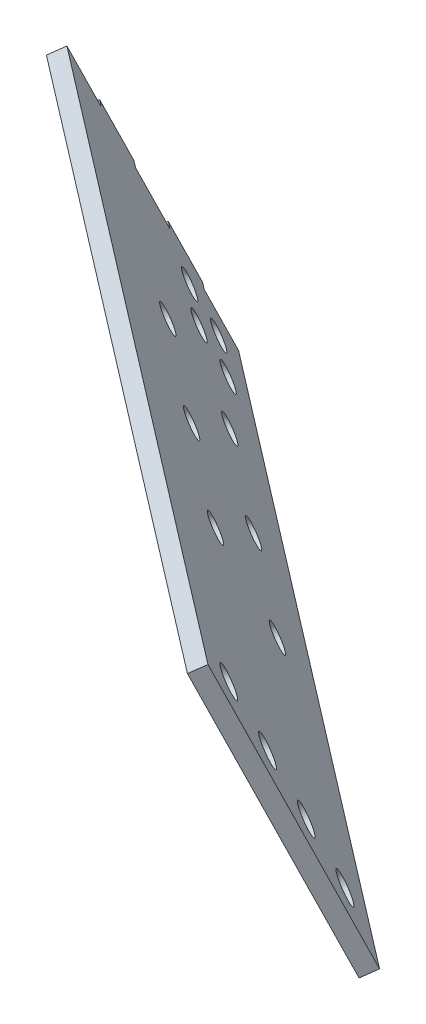
ISO-10303-21;
HEADER;
FILE_DESCRIPTION(('STEP AP214'),'2;1');
FILE_NAME('part.step','',(''),(''),'','','');
FILE_SCHEMA(('AUTOMOTIVE_DESIGN { 1 0 10303 214 1 1 1 1 }'));
ENDSEC;
DATA;
#1=APPLICATION_CONTEXT('core data for automotive mechanical design processes');
#2=APPLICATION_PROTOCOL_DEFINITION('international standard','automotive_design',2000,#1);
#3=PRODUCT_CONTEXT('',#1,'mechanical');
#4=PRODUCT('Part','Part','',(#3));
#5=PRODUCT_RELATED_PRODUCT_CATEGORY('part','',(#4));
#6=PRODUCT_DEFINITION_FORMATION('','',#4);
#7=PRODUCT_DEFINITION_CONTEXT('part definition',#1,'design');
#8=PRODUCT_DEFINITION('design','',#6,#7);
#9=PRODUCT_DEFINITION_SHAPE('','',#8);
#10=(LENGTH_UNIT() NAMED_UNIT(*) SI_UNIT(.MILLI.,.METRE.));
#11=(NAMED_UNIT(*) PLANE_ANGLE_UNIT() SI_UNIT($,.RADIAN.));
#12=(NAMED_UNIT(*) SI_UNIT($,.STERADIAN.) SOLID_ANGLE_UNIT());
#13=UNCERTAINTY_MEASURE_WITH_UNIT(LENGTH_MEASURE(1.E-05),#10,'distance_accuracy_value','');
#14=(GEOMETRIC_REPRESENTATION_CONTEXT(3) GLOBAL_UNCERTAINTY_ASSIGNED_CONTEXT((#13)) GLOBAL_UNIT_ASSIGNED_CONTEXT((#10,
#11,#12)) REPRESENTATION_CONTEXT('',''));
#15=CARTESIAN_POINT('',(0.,0.,0.));
#16=DIRECTION('',(0.,0.,1.));
#17=DIRECTION('',(1.,0.,0.));
#18=AXIS2_PLACEMENT_3D('',#15,#16,#17);
#19=CARTESIAN_POINT('',(14.5467046392581,44.45,-33.02));
#20=DIRECTION('',(0.79335334029123,0.,0.608761429008727));
#21=DIRECTION('',(0.247605580069034,-0.913545457642603,-0.322685874403024));
#22=AXIS2_PLACEMENT_3D('',#19,#20,#21);
#23=PLANE('',#22);
#24=DIRECTION('',(0.556131238258943,0.406736643075794,-0.72476434032864));
#25=VECTOR('',#24,1.);
#26=CARTESIAN_POINT('',(8.75342284130712,36.2336291981627,-25.4700481688912));
#27=LINE('',#26,#25);
#28=CARTESIAN_POINT('',(15.4468292939168,41.1289731097893,-34.193065288671));
#29=VERTEX_POINT('',#28);
#30=CARTESIAN_POINT('',(17.1136658412265,42.3480441764161,-36.365328969504));
#31=VERTEX_POINT('',#30);
#32=EDGE_CURVE('E134',#29,#31,#27,.T.);
#33=ORIENTED_EDGE('',*,*,#32,.F.);
#34=DIRECTION('',(0.247605580069034,-0.913545457642603,-0.322685874403024));
#35=VECTOR('',#34,1.);
#36=CARTESIAN_POINT('',(14.5467046392581,44.45,-33.02));
#37=LINE('',#36,#35);
#38=CARTESIAN_POINT('',(12.6599501191321,51.4112163872367,-30.561133637049));
#39=VERTEX_POINT('',#38);
#40=EDGE_CURVE('E141',#39,#29,#37,.T.);
#41=ORIENTED_EDGE('',*,*,#40,.F.);
#42=DIRECTION('',(-0.556131238258943,-0.406736643075794,0.72476434032864));
#43=VECTOR('',#42,1.);
#44=CARTESIAN_POINT('',(12.6599501191321,51.4112163872367,-30.561133637049));
#45=LINE('',#44,#43);
#46=CARTESIAN_POINT('',(14.3267866664418,52.6302874538634,-32.733397317882));
#47=VERTEX_POINT('',#46);
#48=EDGE_CURVE('E45',#47,#39,#45,.T.);
#49=ORIENTED_EDGE('',*,*,#48,.F.);
#50=DIRECTION('',(-0.247605580069033,0.913545457642604,0.322685874403023));
#51=VECTOR('',#50,1.);
#52=CARTESIAN_POINT('',(22.7379885264077,21.5969995516098,-43.6950889978784));
#53=LINE('',#52,#51);
#54=EDGE_CURVE('E151',#47,#31,#53,.F.);
#55=ORIENTED_EDGE('',*,*,#54,.T.);
#56=EDGE_LOOP('',(#33,#41,#49,#55));
#57=FACE_BOUND('',#56,.T.);
#58=ADVANCED_FACE('F35',(#57),#23,.F.);
#59=DIRECTION('',(0.556131238258943,0.406736643075794,-0.72476434032864));
#60=VECTOR('',#59,1.);
#61=CARTESIAN_POINT('',(11.5403020160918,25.9513859207153,-29.1019798205133));
#62=LINE('',#61,#60);
#63=CARTESIAN_POINT('',(18.2337084687014,30.846729832342,-37.8249969402931));
#64=VERTEX_POINT('',#63);
#65=CARTESIAN_POINT('',(19.9005450160111,32.0658008989688,-39.9972606211261));
#66=VERTEX_POINT('',#65);
#67=EDGE_CURVE('E160',#64,#66,#62,.T.);
#68=ORIENTED_EDGE('',*,*,#67,.T.);
#69=CARTESIAN_POINT('',(22.6874241907957,21.7835576215214,-43.6291922727481));
#70=VERTEX_POINT('',#69);
#71=EDGE_CURVE('E213',#66,#70,#53,.F.);
#72=ORIENTED_EDGE('',*,*,#71,.T.);
#73=DIRECTION('',(0.556131238258943,0.406736643075794,-0.72476434032864));
#74=VECTOR('',#73,1.);
#75=CARTESIAN_POINT('',(14.3271811908764,15.669142643268,-32.7339114721353));
#76=LINE('',#75,#74);
#77=CARTESIAN_POINT('',(21.020587643486,20.5644865548946,-41.4569285919151));
#78=VERTEX_POINT('',#77);
#79=EDGE_CURVE('E167',#78,#70,#76,.T.);
#80=ORIENTED_EDGE('',*,*,#79,.F.);
#81=EDGE_CURVE('E39',#64,#78,#37,.T.);
#82=ORIENTED_EDGE('',*,*,#81,.F.);
#83=EDGE_LOOP('',(#68,#72,#80,#82));
#84=FACE_BOUND('',#83,.T.);
#85=ADVANCED_FACE('F244',(#84),#23,.F.);
#86=DIRECTION('',(0.556131238258943,0.406736643075794,-0.72476434032864));
#87=VECTOR('',#86,1.);
#88=CARTESIAN_POINT('',(17.114060365661,5.38689936582066,-36.3658431237573));
#89=LINE('',#88,#87);
#90=CARTESIAN_POINT('',(23.8074668182706,10.2822432774473,-45.0888602435371));
#91=VERTEX_POINT('',#90);
#92=CARTESIAN_POINT('',(25.4743033655803,11.5013143440741,-47.2611239243701));
#93=VERTEX_POINT('',#92);
#94=EDGE_CURVE('E174',#91,#93,#89,.T.);
#95=ORIENTED_EDGE('',*,*,#94,.T.);
#96=CARTESIAN_POINT('',(28.261182540365,1.21907106662677,-50.8930555759921));
#97=VERTEX_POINT('',#96);
#98=EDGE_CURVE('E212',#93,#97,#53,.F.);
#99=ORIENTED_EDGE('',*,*,#98,.T.);
#100=DIRECTION('',(-0.556131238258943,-0.406736643075794,0.72476434032864));
#101=VECTOR('',#100,1.);
#102=CARTESIAN_POINT('',(26.5943459930553,0.,-48.7207918951591));
#103=LINE('',#102,#101);
#104=CARTESIAN_POINT('',(26.5943459930553,0.,-48.7207918951591));
#105=VERTEX_POINT('',#104);
#106=EDGE_CURVE('E11',#97,#105,#103,.T.);
#107=ORIENTED_EDGE('',*,*,#106,.T.);
#108=EDGE_CURVE('E201',#91,#105,#37,.T.);
#109=ORIENTED_EDGE('',*,*,#108,.F.);
#110=EDGE_LOOP('',(#95,#99,#107,#109));
#111=FACE_BOUND('',#110,.T.);
#112=ADVANCED_FACE('F231',(#111),#23,.F.);
#113=CARTESIAN_POINT('',(150.825537827718,51.4112163872366,75.4570506217247));
#114=DIRECTION('',(-0.247605580069033,0.913545457642604,0.322685874403023));
#115=DIRECTION('',(0.793353340291231,0.,0.608761429008727));
#116=AXIS2_PLACEMENT_3D('',#113,#114,#115);
#117=PLANE('',#116);
#118=DIRECTION('',(0.556131238258943,0.406736643075795,-0.72476434032864));
#119=VECTOR('',#118,1.);
#120=CARTESIAN_POINT('',(-31.9766845844257,-64.1354295160414,262.308313646661));
#121=LINE('',#120,#119);
#122=CARTESIAN_POINT('',(126.010308613242,51.4112163872367,56.4156555325728));
#123=VERTEX_POINT('',#122);
#124=CARTESIAN_POINT('',(127.677145160551,52.6302874538634,54.2433918517398));
#125=VERTEX_POINT('',#124);
#126=EDGE_CURVE('E191',#123,#125,#121,.T.);
#127=ORIENTED_EDGE('',*,*,#126,.T.);
#128=DIRECTION('',(-0.79335334029123,0.,-0.608761429008727));
#129=VECTOR('',#128,1.);
#130=CARTESIAN_POINT('',(21.1183876367849,52.6302874538634,-27.5220186017536));
#131=LINE('',#130,#129);
#132=EDGE_CURVE('E202',#47,#125,#131,.F.);
#133=ORIENTED_EDGE('',*,*,#132,.F.);
#134=ORIENTED_EDGE('',*,*,#48,.T.);
#135=DIRECTION('',(0.793353340291231,0.,0.608761429008727));
#136=VECTOR('',#135,1.);
#137=CARTESIAN_POINT('',(150.825537827718,51.4112163872366,75.4570506217247));
#138=LINE('',#137,#136);
#139=EDGE_CURVE('E144',#39,#123,#138,.T.);
#140=ORIENTED_EDGE('',*,*,#139,.T.);
#141=EDGE_LOOP('',(#127,#133,#134,#140));
#142=FACE_BOUND('',#141,.T.);
#143=ADVANCED_FACE('F219',(#142),#117,.T.);
#144=CARTESIAN_POINT('',(33.3859469633983,0.,-43.5094131790307));
#145=DIRECTION('',(0.247605580069033,-0.913545457642604,-0.322685874403023));
#146=DIRECTION('',(-0.79335334029123,0.,-0.608761429008727));
#147=AXIS2_PLACEMENT_3D('',#144,#145,#146);
#148=PLANE('',#147);
#149=DIRECTION('',(-0.79335334029123,0.,-0.608761429008727));
#150=VECTOR('',#149,1.);
#151=CARTESIAN_POINT('',(35.052783510708,1.21907106662677,-45.6816768598637));
#152=LINE('',#151,#150);
#153=CARTESIAN_POINT('',(141.611541034475,1.21907106662672,36.0837335936297));
#154=VERTEX_POINT('',#153);
#155=EDGE_CURVE('E199',#154,#97,#152,.T.);
#156=ORIENTED_EDGE('',*,*,#155,.F.);
#157=DIRECTION('',(0.556131238258943,0.406736643075795,-0.72476434032864));
#158=VECTOR('',#157,1.);
#159=CARTESIAN_POINT('',(-18.0422887105026,-115.546645903278,244.14865538855));
#160=LINE('',#159,#158);
#161=CARTESIAN_POINT('',(139.944704487165,0.,38.2559972744627));
#162=VERTEX_POINT('',#161);
#163=EDGE_CURVE('E192',#162,#154,#160,.T.);
#164=ORIENTED_EDGE('',*,*,#163,.F.);
#165=DIRECTION('',(-0.79335334029123,0.,-0.608761429008727));
#166=VECTOR('',#165,1.);
#167=CARTESIAN_POINT('',(33.3859469633983,0.,-43.5094131790307));
#168=LINE('',#167,#166);
#169=EDGE_CURVE('E200',#162,#105,#168,.T.);
#170=ORIENTED_EDGE('',*,*,#169,.T.);
#171=ORIENTED_EDGE('',*,*,#106,.F.);
#172=EDGE_LOOP('',(#156,#164,#170,#171));
#173=FACE_BOUND('',#172,.T.);
#174=ADVANCED_FACE('F37',(#173),#148,.T.);
#175=CARTESIAN_POINT('',(27.862752949441,20.3779284849831,-36.3114466009171));
#176=DIRECTION('',(-0.556131238258943,-0.406736643075794,0.72476434032864));
#177=DIRECTION('',(-0.79335334029123,0.,-0.608761429008727));
#178=AXIS2_PLACEMENT_3D('',#175,#176,#177);
#179=PLANE('',#178);
#180=CARTESIAN_POINT('',(46.8476183837827,31.9778206395344,-15.2340051939125));
#181=DIRECTION('',(0.556131238258943,0.406736643075794,-0.72476434032864));
#182=DIRECTION('',(-0.79335334029123,0.,-0.608761429008727));
#183=AXIS2_PLACEMENT_3D('',#180,#181,#182);
#184=CIRCLE('',#183,2.55269999999998);
#185=CARTESIAN_POINT('',(44.8224253120213,31.9778206395344,-16.787990493743));
#186=VERTEX_POINT('',#185);
#187=EDGE_CURVE('E254',#186,#186,#184,.T.);
#188=ORIENTED_EDGE('',*,*,#187,.T.);
#189=EDGE_LOOP('',(#188));
#190=FACE_BOUND('',#189,.T.);
#191=CARTESIAN_POINT('',(71.0225798720128,13.4145769402367,-7.10156887980132));
#192=DIRECTION('',(0.556131238258943,0.406736643075794,-0.72476434032864));
#193=DIRECTION('',(-0.79335334029123,0.,-0.608761429008727));
#194=AXIS2_PLACEMENT_3D('',#191,#192,#193);
#195=CIRCLE('',#194,2.55269999999995);
#196=CARTESIAN_POINT('',(68.9973868002515,13.4145769402367,-8.65555417963186));
#197=VERTEX_POINT('',#196);
#198=EDGE_CURVE('E258',#197,#197,#195,.T.);
#199=ORIENTED_EDGE('',*,*,#198,.T.);
#200=EDGE_LOOP('',(#199));
#201=FACE_BOUND('',#200,.T.);
#202=CARTESIAN_POINT('',(85.1348502940503,31.9778206395344,14.1448211458456));
#203=DIRECTION('',(0.556131238258943,0.406736643075794,-0.72476434032864));
#204=DIRECTION('',(-0.79335334029123,0.,-0.608761429008727));
#205=AXIS2_PLACEMENT_3D('',#202,#203,#204);
#206=CIRCLE('',#205,2.55269999999986);
#207=CARTESIAN_POINT('',(83.109657222289,31.9778206395344,12.5908358460151));
#208=VERTEX_POINT('',#207);
#209=EDGE_CURVE('E261',#208,#208,#206,.T.);
#210=ORIENTED_EDGE('',*,*,#209,.T.);
#211=EDGE_LOOP('',(#210));
#212=FACE_BOUND('',#211,.T.);
#213=CARTESIAN_POINT('',(65.9912344850101,31.9778206395344,-0.544591911931874));
#214=DIRECTION('',(0.556131238258943,0.406736643075794,-0.72476434032864));
#215=DIRECTION('',(-0.79335334029123,0.,-0.608761429008727));
#216=AXIS2_PLACEMENT_3D('',#213,#214,#215);
#217=CIRCLE('',#216,2.55269999999995);
#218=CARTESIAN_POINT('',(63.9660414132487,31.9778206395344,-2.09857721176242));
#219=VERTEX_POINT('',#218);
#220=EDGE_CURVE('E264',#219,#219,#217,.T.);
#221=ORIENTED_EDGE('',*,*,#220,.T.);
#222=EDGE_LOOP('',(#221));
#223=FACE_BOUND('',#222,.T.);
#224=CARTESIAN_POINT('',(125.408956693522,31.325473742774,44.6821338187698));
#225=DIRECTION('',(0.556131238258943,0.406736643075794,-0.72476434032864));
#226=DIRECTION('',(-0.79335334029123,0.,-0.608761429008727));
#227=AXIS2_PLACEMENT_3D('',#224,#225,#226);
#228=CIRCLE('',#227,2.79400000000009);
#229=CARTESIAN_POINT('',(123.192327460748,31.325473742774,42.9812543861193));
#230=VERTEX_POINT('',#229);
#231=EDGE_CURVE('E267',#230,#230,#228,.T.);
#232=ORIENTED_EDGE('',*,*,#231,.T.);
#233=EDGE_LOOP('',(#232));
#234=FACE_BOUND('',#233,.T.);
#235=CARTESIAN_POINT('',(128.553547560399,19.7234464307129,40.5840232138514));
#236=DIRECTION('',(0.556131238258943,0.406736643075794,-0.72476434032864));
#237=DIRECTION('',(-0.79335334029123,0.,-0.608761429008727));
#238=AXIS2_PLACEMENT_3D('',#235,#236,#237);
#239=CIRCLE('',#238,2.79400000000003);
#240=CARTESIAN_POINT('',(126.336918327625,19.7234464307129,38.8831437812009));
#241=VERTEX_POINT('',#240);
#242=EDGE_CURVE('E270',#241,#241,#239,.T.);
#243=ORIENTED_EDGE('',*,*,#242,.T.);
#244=EDGE_LOOP('',(#243));
#245=FACE_BOUND('',#244,.T.);
#246=CARTESIAN_POINT('',(51.8789637707854,13.4145769402367,-21.7909821617819));
#247=DIRECTION('',(0.556131238258943,0.406736643075794,-0.72476434032864));
#248=DIRECTION('',(-0.79335334029123,0.,-0.608761429008727));
#249=AXIS2_PLACEMENT_3D('',#246,#247,#248);
#250=CIRCLE('',#249,2.55269999999998);
#251=CARTESIAN_POINT('',(49.853770699024,13.4145769402367,-23.3449674616124));
#252=VERTEX_POINT('',#251);
#253=EDGE_CURVE('E273',#252,#252,#250,.T.);
#254=ORIENTED_EDGE('',*,*,#253,.T.);
#255=EDGE_LOOP('',(#254));
#256=FACE_BOUND('',#255,.T.);
#257=CARTESIAN_POINT('',(122.264365826645,42.9275010548351,48.7802444236881));
#258=DIRECTION('',(0.556131238258943,0.406736643075794,-0.72476434032864));
#259=DIRECTION('',(-0.79335334029123,0.,-0.608761429008727));
#260=AXIS2_PLACEMENT_3D('',#257,#258,#259);
#261=CIRCLE('',#260,2.79400000000012);
#262=CARTESIAN_POINT('',(120.047736593871,42.9275010548351,47.0793649910377));
#263=VERTEX_POINT('',#262);
#264=EDGE_CURVE('E276',#263,#263,#261,.T.);
#265=ORIENTED_EDGE('',*,*,#264,.T.);
#266=EDGE_LOOP('',(#265));
#267=FACE_BOUND('',#266,.T.);
#268=CARTESIAN_POINT('',(30.6432056618001,8.29544952812365,-40.9585989698857));
#269=DIRECTION('',(0.556131238258943,0.406736643075794,-0.72476434032864));
#270=DIRECTION('',(-0.79335334029123,0.,-0.608761429008727));
#271=AXIS2_PLACEMENT_3D('',#268,#269,#270);
#272=CIRCLE('',#271,2.55269999999988);
#273=CARTESIAN_POINT('',(28.6180125900388,8.29544952812365,-42.5125842697162));
#274=VERTEX_POINT('',#273);
#275=EDGE_CURVE('E279',#274,#274,#272,.T.);
#276=ORIENTED_EDGE('',*,*,#275,.T.);
#277=EDGE_LOOP('',(#276));
#278=FACE_BOUND('',#277,.T.);
#279=CARTESIAN_POINT('',(28.2847625116426,16.9969700121695,-37.8850160161969));
#280=DIRECTION('',(0.556131238258943,0.406736643075794,-0.72476434032864));
#281=DIRECTION('',(-0.79335334029123,0.,-0.608761429008727));
#282=AXIS2_PLACEMENT_3D('',#279,#280,#281);
#283=CIRCLE('',#282,2.55269999999996);
#284=CARTESIAN_POINT('',(26.2595694398812,16.9969700121695,-39.4390013160275));
#285=VERTEX_POINT('',#284);
#286=EDGE_CURVE('E282',#285,#285,#283,.T.);
#287=ORIENTED_EDGE('',*,*,#286,.T.);
#288=EDGE_LOOP('',(#287));
#289=FACE_BOUND('',#288,.T.);
#290=CARTESIAN_POINT('',(90.1661947951034,13.4145769402367,7.5878434981631));
#291=DIRECTION('',(0.556131238258943,0.406736643075794,-0.72476434032864));
#292=DIRECTION('',(-0.79335334029123,0.,-0.608761429008727));
#293=AXIS2_PLACEMENT_3D('',#290,#291,#292);
#294=CIRCLE('',#293,2.55270000000002);
#295=CARTESIAN_POINT('',(88.1410017233419,13.4145769402367,6.03385819833252));
#296=VERTEX_POINT('',#295);
#297=EDGE_CURVE('E285',#296,#296,#294,.T.);
#298=ORIENTED_EDGE('',*,*,#297,.T.);
#299=EDGE_LOOP('',(#298));
#300=FACE_BOUND('',#299,.T.);
#301=CARTESIAN_POINT('',(38.1998962280741,8.29544952812365,-35.1601463585776));
#302=DIRECTION('',(0.556131238258943,0.406736643075794,-0.72476434032864));
#303=DIRECTION('',(-0.79335334029123,0.,-0.608761429008727));
#304=AXIS2_PLACEMENT_3D('',#301,#302,#303);
#305=CIRCLE('',#304,2.55269999999989);
#306=CARTESIAN_POINT('',(36.1747031563127,8.29544952812365,-36.7141316584081));
#307=VERTEX_POINT('',#306);
#308=EDGE_CURVE('E288',#307,#307,#305,.T.);
#309=ORIENTED_EDGE('',*,*,#308,.T.);
#310=EDGE_LOOP('',(#309));
#311=FACE_BOUND('',#310,.T.);
#312=CARTESIAN_POINT('',(35.8414530779165,16.9969700121695,-32.0865634048888));
#313=DIRECTION('',(0.556131238258943,0.406736643075794,-0.72476434032864));
#314=DIRECTION('',(-0.79335334029123,0.,-0.608761429008727));
#315=AXIS2_PLACEMENT_3D('',#312,#313,#314);
#316=CIRCLE('',#315,2.55269999999996);
#317=CARTESIAN_POINT('',(33.8162600061551,16.9969700121695,-33.6405487047194));
#318=VERTEX_POINT('',#317);
#319=EDGE_CURVE('E291',#318,#318,#316,.T.);
#320=ORIENTED_EDGE('',*,*,#319,.T.);
#321=EDGE_LOOP('',(#320));
#322=FACE_BOUND('',#321,.T.);
#323=CARTESIAN_POINT('',(131.698138427275,8.12141911865187,36.485912608933));
#324=DIRECTION('',(0.556131238258943,0.406736643075794,-0.72476434032864));
#325=DIRECTION('',(-0.79335334029123,0.,-0.608761429008727));
#326=AXIS2_PLACEMENT_3D('',#323,#324,#325);
#327=CIRCLE('',#326,2.79399999999997);
#328=CARTESIAN_POINT('',(129.481509194502,8.12141911865187,34.7850331762826));
#329=VERTEX_POINT('',#328);
#330=EDGE_CURVE('E294',#329,#329,#327,.T.);
#331=ORIENTED_EDGE('',*,*,#330,.T.);
#332=EDGE_LOOP('',(#331));
#333=FACE_BOUND('',#332,.T.);
#334=DIRECTION('',(-0.247605580069033,0.913545457642604,0.322685874403023));
#335=VECTOR('',#334,1.);
#336=CARTESIAN_POINT('',(134.421510473207,20.3779284849831,45.4539638525764));
#337=LINE('',#336,#335);
#338=EDGE_CURVE('E195',#162,#123,#337,.T.);
#339=ORIENTED_EDGE('',*,*,#338,.T.);
#340=ORIENTED_EDGE('',*,*,#139,.F.);
#341=ORIENTED_EDGE('',*,*,#40,.T.);
#342=DIRECTION('',(-0.793353340291231,0.,-0.608761429008726));
#343=VECTOR('',#342,1.);
#344=CARTESIAN_POINT('',(15.4468292939168,41.1289731097893,-34.193065288671));
#345=LINE('',#344,#343);
#346=CARTESIAN_POINT('',(14.0819374718157,41.1289731097893,-35.240383619441));
#347=VERTEX_POINT('',#346);
#348=EDGE_CURVE('E129',#29,#347,#345,.T.);
#349=ORIENTED_EDGE('',*,*,#348,.T.);
#350=DIRECTION('',(0.247605580069032,-0.913545457642604,-0.322685874403024));
#351=VECTOR('',#350,1.);
#352=CARTESIAN_POINT('',(16.8688166466003,30.846729832342,-38.872315271063));
#353=LINE('',#352,#351);
#354=CARTESIAN_POINT('',(16.8688166466003,30.846729832342,-38.872315271063));
#355=VERTEX_POINT('',#354);
#356=EDGE_CURVE('E249',#347,#355,#353,.T.);
#357=ORIENTED_EDGE('',*,*,#356,.T.);
#358=DIRECTION('',(0.793353340291231,0.,0.608761429008727));
#359=VECTOR('',#358,1.);
#360=CARTESIAN_POINT('',(18.2337084687014,30.846729832342,-37.8249969402931));
#361=LINE('',#360,#359);
#362=EDGE_CURVE('E163',#355,#64,#361,.T.);
#363=ORIENTED_EDGE('',*,*,#362,.T.);
#364=ORIENTED_EDGE('',*,*,#81,.T.);
#365=DIRECTION('',(-0.793353340291232,0.,-0.608761429008725));
#366=VECTOR('',#365,1.);
#367=CARTESIAN_POINT('',(21.020587643486,20.5644865548946,-41.4569285919151));
#368=LINE('',#367,#366);
#369=CARTESIAN_POINT('',(19.655695821385,20.5644865548946,-42.504246922685));
#370=VERTEX_POINT('',#369);
#371=EDGE_CURVE('E180',#78,#370,#368,.T.);
#372=ORIENTED_EDGE('',*,*,#371,.T.);
#373=DIRECTION('',(0.247605580069034,-0.913545457642604,-0.322685874403022));
#374=VECTOR('',#373,1.);
#375=CARTESIAN_POINT('',(22.4425749961696,10.2822432774473,-46.136178574307));
#376=LINE('',#375,#374);
#377=CARTESIAN_POINT('',(22.4425749961696,10.2822432774473,-46.136178574307));
#378=VERTEX_POINT('',#377);
#379=EDGE_CURVE('E176',#370,#378,#376,.T.);
#380=ORIENTED_EDGE('',*,*,#379,.T.);
#381=DIRECTION('',(0.793353340291234,0.,0.608761429008721));
#382=VECTOR('',#381,1.);
#383=CARTESIAN_POINT('',(23.8074668182706,10.2822432774473,-45.0888602435371));
#384=LINE('',#383,#382);
#385=EDGE_CURVE('E172',#378,#91,#384,.T.);
#386=ORIENTED_EDGE('',*,*,#385,.T.);
#387=ORIENTED_EDGE('',*,*,#108,.T.);
#388=ORIENTED_EDGE('',*,*,#169,.F.);
#389=EDGE_LOOP('',(#339,#340,#341,#349,#357,#363,#364,#372,#380,#386,#387,#388));
#390=FACE_BOUND('',#389,.T.);
#391=ADVANCED_FACE('F142',(#190,#201,#212,#223,#234,#245,#256,#267,#278,#289,#300,#311,#322,
#333,#390),#179,.T.);
#392=CARTESIAN_POINT('',(29.5295894967507,21.5969995516098,-38.4837102817501));
#393=DIRECTION('',(-0.556131238258943,-0.406736643075794,0.72476434032864));
#394=DIRECTION('',(-0.79335334029123,0.,-0.608761429008727));
#395=AXIS2_PLACEMENT_3D('',#392,#393,#394);
#396=PLANE('',#395);
#397=CARTESIAN_POINT('',(48.5144549310924,33.1968917061611,-17.4062688747455));
#398=DIRECTION('',(-0.556131238258943,-0.406736643075794,0.72476434032864));
#399=DIRECTION('',(0.793353340291231,0.,0.608761429008727));
#400=AXIS2_PLACEMENT_3D('',#397,#398,#399);
#401=CIRCLE('',#400,2.55269999999998);
#402=CARTESIAN_POINT('',(50.5396480028538,33.1968917061611,-15.8522835749149));
#403=VERTEX_POINT('',#402);
#404=EDGE_CURVE('E315',#403,#403,#401,.T.);
#405=ORIENTED_EDGE('',*,*,#404,.T.);
#406=EDGE_LOOP('',(#405));
#407=FACE_BOUND('',#406,.T.);
#408=CARTESIAN_POINT('',(72.6894164193225,14.6336480068634,-9.2738325606343));
#409=DIRECTION('',(-0.556131238258943,-0.406736643075794,0.72476434032864));
#410=DIRECTION('',(0.793353340291231,0.,0.608761429008727));
#411=AXIS2_PLACEMENT_3D('',#408,#409,#410);
#412=CIRCLE('',#411,2.55269999999995);
#413=CARTESIAN_POINT('',(74.7146094910839,14.6336480068634,-7.71984726080375));
#414=VERTEX_POINT('',#413);
#415=EDGE_CURVE('E312',#414,#414,#412,.T.);
#416=ORIENTED_EDGE('',*,*,#415,.T.);
#417=EDGE_LOOP('',(#416));
#418=FACE_BOUND('',#417,.T.);
#419=CARTESIAN_POINT('',(86.8016868413599,33.1968917061611,11.9725574650126));
#420=DIRECTION('',(-0.556131238258943,-0.406736643075794,0.72476434032864));
#421=DIRECTION('',(0.793353340291231,0.,0.608761429008727));
#422=AXIS2_PLACEMENT_3D('',#419,#420,#421);
#423=CIRCLE('',#422,2.55269999999986);
#424=CARTESIAN_POINT('',(88.8268799131213,33.1968917061611,13.5265427648431));
#425=VERTEX_POINT('',#424);
#426=EDGE_CURVE('E321',#425,#425,#423,.T.);
#427=ORIENTED_EDGE('',*,*,#426,.T.);
#428=EDGE_LOOP('',(#427));
#429=FACE_BOUND('',#428,.T.);
#430=CARTESIAN_POINT('',(67.6580710323198,33.1968917061611,-2.71685559276486));
#431=DIRECTION('',(-0.556131238258943,-0.406736643075794,0.72476434032864));
#432=DIRECTION('',(0.793353340291231,0.,0.608761429008727));
#433=AXIS2_PLACEMENT_3D('',#430,#431,#432);
#434=CIRCLE('',#433,2.55269999999995);
#435=CARTESIAN_POINT('',(69.6832641040811,33.1968917061611,-1.16287029293431));
#436=VERTEX_POINT('',#435);
#437=EDGE_CURVE('E318',#436,#436,#434,.T.);
#438=ORIENTED_EDGE('',*,*,#437,.T.);
#439=EDGE_LOOP('',(#438));
#440=FACE_BOUND('',#439,.T.);
#441=CARTESIAN_POINT('',(127.075793240832,32.5445448094008,42.5098701379368));
#442=DIRECTION('',(-0.556131238258943,-0.406736643075794,0.72476434032864));
#443=DIRECTION('',(0.793353340291231,0.,0.608761429008727));
#444=AXIS2_PLACEMENT_3D('',#441,#442,#443);
#445=CIRCLE('',#444,2.79400000000009);
#446=CARTESIAN_POINT('',(129.292422473605,32.5445448094008,44.2107495705872));
#447=VERTEX_POINT('',#446);
#448=EDGE_CURVE('E303',#447,#447,#445,.T.);
#449=ORIENTED_EDGE('',*,*,#448,.T.);
#450=EDGE_LOOP('',(#449));
#451=FACE_BOUND('',#450,.T.);
#452=CARTESIAN_POINT('',(130.220384107708,20.9425174973397,38.4117595330184));
#453=DIRECTION('',(-0.556131238258943,-0.406736643075794,0.72476434032864));
#454=DIRECTION('',(0.793353340291231,0.,0.608761429008727));
#455=AXIS2_PLACEMENT_3D('',#452,#453,#454);
#456=CIRCLE('',#455,2.79400000000003);
#457=CARTESIAN_POINT('',(132.437013340482,20.9425174973397,40.1126389656688));
#458=VERTEX_POINT('',#457);
#459=EDGE_CURVE('E300',#458,#458,#456,.T.);
#460=ORIENTED_EDGE('',*,*,#459,.T.);
#461=EDGE_LOOP('',(#460));
#462=FACE_BOUND('',#461,.T.);
#463=CARTESIAN_POINT('',(53.5458003180951,14.6336480068634,-23.9632458426149));
#464=DIRECTION('',(-0.556131238258943,-0.406736643075794,0.72476434032864));
#465=DIRECTION('',(0.793353340291231,0.,0.608761429008727));
#466=AXIS2_PLACEMENT_3D('',#463,#464,#465);
#467=CIRCLE('',#466,2.55269999999998);
#468=CARTESIAN_POINT('',(55.5709933898565,14.6336480068634,-22.4092605427843));
#469=VERTEX_POINT('',#468);
#470=EDGE_CURVE('E309',#469,#469,#467,.T.);
#471=ORIENTED_EDGE('',*,*,#470,.T.);
#472=EDGE_LOOP('',(#471));
#473=FACE_BOUND('',#472,.T.);
#474=CARTESIAN_POINT('',(123.931202373955,44.1465721214618,46.6079807428551));
#475=DIRECTION('',(-0.556131238258943,-0.406736643075794,0.72476434032864));
#476=DIRECTION('',(0.793353340291231,0.,0.608761429008727));
#477=AXIS2_PLACEMENT_3D('',#474,#475,#476);
#478=CIRCLE('',#477,2.79400000000012);
#479=CARTESIAN_POINT('',(126.147831606729,44.1465721214618,48.3088601755056));
#480=VERTEX_POINT('',#479);
#481=EDGE_CURVE('E306',#480,#480,#478,.T.);
#482=ORIENTED_EDGE('',*,*,#481,.T.);
#483=EDGE_LOOP('',(#482));
#484=FACE_BOUND('',#483,.T.);
#485=CARTESIAN_POINT('',(32.3100422091098,9.51452059475042,-43.1308626507187));
#486=DIRECTION('',(-0.556131238258943,-0.406736643075794,0.72476434032864));
#487=DIRECTION('',(0.793353340291231,0.,0.608761429008727));
#488=AXIS2_PLACEMENT_3D('',#485,#486,#487);
#489=CIRCLE('',#488,2.55269999999988);
#490=CARTESIAN_POINT('',(34.3352352808711,9.51452059475042,-41.5768773508882));
#491=VERTEX_POINT('',#490);
#492=EDGE_CURVE('E336',#491,#491,#489,.T.);
#493=ORIENTED_EDGE('',*,*,#492,.T.);
#494=EDGE_LOOP('',(#493));
#495=FACE_BOUND('',#494,.T.);
#496=CARTESIAN_POINT('',(29.9515990589522,18.2160410787962,-40.0572796970299));
#497=DIRECTION('',(-0.556131238258943,-0.406736643075794,0.72476434032864));
#498=DIRECTION('',(0.793353340291231,0.,0.608761429008727));
#499=AXIS2_PLACEMENT_3D('',#496,#497,#498);
#500=CIRCLE('',#499,2.55269999999996);
#501=CARTESIAN_POINT('',(31.9767921307136,18.2160410787962,-38.5032943971994));
#502=VERTEX_POINT('',#501);
#503=EDGE_CURVE('E327',#502,#502,#500,.T.);
#504=ORIENTED_EDGE('',*,*,#503,.T.);
#505=EDGE_LOOP('',(#504));
#506=FACE_BOUND('',#505,.T.);
#507=CARTESIAN_POINT('',(91.8330313424131,14.6336480068634,5.41557981733011));
#508=DIRECTION('',(-0.556131238258943,-0.406736643075794,0.72476434032864));
#509=DIRECTION('',(0.793353340291231,0.,0.608761429008727));
#510=AXIS2_PLACEMENT_3D('',#507,#508,#509);
#511=CIRCLE('',#510,2.55270000000002);
#512=CARTESIAN_POINT('',(93.8582244141745,14.6336480068634,6.9695651171607));
#513=VERTEX_POINT('',#512);
#514=EDGE_CURVE('E324',#513,#513,#511,.T.);
#515=ORIENTED_EDGE('',*,*,#514,.T.);
#516=EDGE_LOOP('',(#515));
#517=FACE_BOUND('',#516,.T.);
#518=CARTESIAN_POINT('',(39.8667327753837,9.51452059475042,-37.3324100394106));
#519=DIRECTION('',(-0.556131238258943,-0.406736643075794,0.72476434032864));
#520=DIRECTION('',(0.793353340291231,0.,0.608761429008727));
#521=AXIS2_PLACEMENT_3D('',#518,#519,#520);
#522=CIRCLE('',#521,2.55269999999989);
#523=CARTESIAN_POINT('',(41.8919258471451,9.51452059475042,-35.7784247395801));
#524=VERTEX_POINT('',#523);
#525=EDGE_CURVE('E333',#524,#524,#522,.T.);
#526=ORIENTED_EDGE('',*,*,#525,.T.);
#527=EDGE_LOOP('',(#526));
#528=FACE_BOUND('',#527,.T.);
#529=CARTESIAN_POINT('',(37.5082896252262,18.2160410787962,-34.2588270857218));
#530=DIRECTION('',(-0.556131238258943,-0.406736643075794,0.72476434032864));
#531=DIRECTION('',(0.793353340291231,0.,0.608761429008727));
#532=AXIS2_PLACEMENT_3D('',#529,#530,#531);
#533=CIRCLE('',#532,2.55269999999996);
#534=CARTESIAN_POINT('',(39.5334826969876,18.2160410787962,-32.7048417858912));
#535=VERTEX_POINT('',#534);
#536=EDGE_CURVE('E330',#535,#535,#533,.T.);
#537=ORIENTED_EDGE('',*,*,#536,.T.);
#538=EDGE_LOOP('',(#537));
#539=FACE_BOUND('',#538,.T.);
#540=CARTESIAN_POINT('',(133.364974974585,9.34049018527864,34.3136489281));
#541=DIRECTION('',(-0.556131238258943,-0.406736643075794,0.72476434032864));
#542=DIRECTION('',(0.793353340291231,0.,0.608761429008727));
#543=AXIS2_PLACEMENT_3D('',#540,#541,#542);
#544=CIRCLE('',#543,2.79399999999997);
#545=CARTESIAN_POINT('',(135.581604207359,9.34049018527864,36.0145283607503));
#546=VERTEX_POINT('',#545);
#547=EDGE_CURVE('E297',#546,#546,#544,.T.);
#548=ORIENTED_EDGE('',*,*,#547,.T.);
#549=EDGE_LOOP('',(#548));
#550=FACE_BOUND('',#549,.T.);
#551=ORIENTED_EDGE('',*,*,#155,.T.);
#552=ORIENTED_EDGE('',*,*,#98,.F.);
#553=DIRECTION('',(0.793353340291236,0.,0.608761429008719));
#554=VECTOR('',#553,1.);
#555=CARTESIAN_POINT('',(25.4743033655804,11.5013143440741,-47.2611239243701));
#556=LINE('',#555,#554);
#557=CARTESIAN_POINT('',(24.1094115434793,11.5013143440741,-48.30844225514));
#558=VERTEX_POINT('',#557);
#559=EDGE_CURVE('E61',#558,#93,#556,.T.);
#560=ORIENTED_EDGE('',*,*,#559,.F.);
#561=DIRECTION('',(0.247605580069034,-0.913545457642604,-0.322685874403022));
#562=VECTOR('',#561,1.);
#563=CARTESIAN_POINT('',(24.1094115434793,11.5013143440741,-48.30844225514));
#564=LINE('',#563,#562);
#565=CARTESIAN_POINT('',(21.3225323686947,21.7835576215214,-44.676510603518));
#566=VERTEX_POINT('',#565);
#567=EDGE_CURVE('E164',#566,#558,#564,.T.);
#568=ORIENTED_EDGE('',*,*,#567,.F.);
#569=DIRECTION('',(-0.793353340291233,0.,-0.608761429008724));
#570=VECTOR('',#569,1.);
#571=CARTESIAN_POINT('',(22.6874241907957,21.7835576215214,-43.6291922727481));
#572=LINE('',#571,#570);
#573=EDGE_CURVE('E168',#70,#566,#572,.T.);
#574=ORIENTED_EDGE('',*,*,#573,.F.);
#575=ORIENTED_EDGE('',*,*,#71,.F.);
#576=DIRECTION('',(0.79335334029123,0.,0.608761429008727));
#577=VECTOR('',#576,1.);
#578=CARTESIAN_POINT('',(19.9005450160111,32.0658008989688,-39.9972606211261));
#579=LINE('',#578,#577);
#580=CARTESIAN_POINT('',(18.53565319391,32.0658008989688,-41.044578951896));
#581=VERTEX_POINT('',#580);
#582=EDGE_CURVE('E53',#581,#66,#579,.T.);
#583=ORIENTED_EDGE('',*,*,#582,.F.);
#584=DIRECTION('',(0.247605580069032,-0.913545457642603,-0.322685874403024));
#585=VECTOR('',#584,1.);
#586=CARTESIAN_POINT('',(18.53565319391,32.0658008989688,-41.044578951896));
#587=LINE('',#586,#585);
#588=CARTESIAN_POINT('',(15.7487740191254,42.3480441764161,-37.412647300274));
#589=VERTEX_POINT('',#588);
#590=EDGE_CURVE('E152',#589,#581,#587,.T.);
#591=ORIENTED_EDGE('',*,*,#590,.F.);
#592=DIRECTION('',(-0.793353340291231,0.,-0.608761429008726));
#593=VECTOR('',#592,1.);
#594=CARTESIAN_POINT('',(17.1136658412265,42.3480441764161,-36.365328969504));
#595=LINE('',#594,#593);
#596=EDGE_CURVE('E155',#31,#589,#595,.T.);
#597=ORIENTED_EDGE('',*,*,#596,.F.);
#598=ORIENTED_EDGE('',*,*,#54,.F.);
#599=ORIENTED_EDGE('',*,*,#132,.T.);
#600=DIRECTION('',(0.247605580069034,-0.913545457642603,-0.322685874403023));
#601=VECTOR('',#600,1.);
#602=CARTESIAN_POINT('',(141.611541034475,1.21907106662672,36.0837335936297));
#603=LINE('',#602,#601);
#604=EDGE_CURVE('E189',#125,#154,#603,.T.);
#605=ORIENTED_EDGE('',*,*,#604,.T.);
#606=EDGE_LOOP('',(#551,#552,#560,#568,#574,#575,#583,#591,#597,#598,#599,#605));
#607=FACE_BOUND('',#606,.T.);
#608=ADVANCED_FACE('F216',(#407,#418,#429,#440,#451,#462,#473,#484,#495,#506,#517,#528,#539,
#550,#607),#396,.F.);
#609=CARTESIAN_POINT('',(-18.0422887105026,-115.546645903278,244.14865538855));
#610=DIRECTION('',(-0.79335334029123,0.,-0.608761429008727));
#611=DIRECTION('',(0.608761429008727,0.,-0.79335334029123));
#612=AXIS2_PLACEMENT_3D('',#609,#610,#611);
#613=PLANE('',#612);
#614=ORIENTED_EDGE('',*,*,#338,.F.);
#615=ORIENTED_EDGE('',*,*,#163,.T.);
#616=ORIENTED_EDGE('',*,*,#604,.F.);
#617=ORIENTED_EDGE('',*,*,#126,.F.);
#618=EDGE_LOOP('',(#614,#615,#616,#617));
#619=FACE_BOUND('',#618,.T.);
#620=ADVANCED_FACE('F221',(#619),#613,.F.);
#621=CARTESIAN_POINT('',(14.3271811908764,15.669142643268,-32.7339114721353));
#622=DIRECTION('',(-0.247605580069029,0.913545457642604,0.322685874403027));
#623=DIRECTION('',(0.,-0.333056962771195,0.94290670776574));
#624=AXIS2_PLACEMENT_3D('',#621,#622,#623);
#625=PLANE('',#624);
#626=ORIENTED_EDGE('',*,*,#79,.T.);
#627=ORIENTED_EDGE('',*,*,#573,.T.);
#628=DIRECTION('',(0.556131238258943,0.406736643075794,-0.72476434032864));
#629=VECTOR('',#628,1.);
#630=CARTESIAN_POINT('',(12.9622893687753,15.669142643268,-33.7812298029052));
#631=LINE('',#630,#629);
#632=EDGE_CURVE('E179',#370,#566,#631,.T.);
#633=ORIENTED_EDGE('',*,*,#632,.F.);
#634=ORIENTED_EDGE('',*,*,#371,.F.);
#635=EDGE_LOOP('',(#626,#627,#633,#634));
#636=FACE_BOUND('',#635,.T.);
#637=ADVANCED_FACE('F241',(#636),#625,.T.);
#638=CARTESIAN_POINT('',(15.74916854356,5.38689936582068,-37.4131614545272));
#639=DIRECTION('',(-0.79335334029123,0.,-0.608761429008727));
#640=DIRECTION('',(0.608761429008727,0.,-0.79335334029123));
#641=AXIS2_PLACEMENT_3D('',#638,#639,#640);
#642=PLANE('',#641);
#643=ORIENTED_EDGE('',*,*,#632,.T.);
#644=ORIENTED_EDGE('',*,*,#567,.T.);
#645=DIRECTION('',(0.556131238258943,0.406736643075794,-0.72476434032864));
#646=VECTOR('',#645,1.);
#647=CARTESIAN_POINT('',(15.74916854356,5.38689936582068,-37.4131614545272));
#648=LINE('',#647,#646);
#649=EDGE_CURVE('E175',#378,#558,#648,.T.);
#650=ORIENTED_EDGE('',*,*,#649,.F.);
#651=ORIENTED_EDGE('',*,*,#379,.F.);
#652=EDGE_LOOP('',(#643,#644,#650,#651));
#653=FACE_BOUND('',#652,.T.);
#654=ADVANCED_FACE('F237',(#653),#642,.T.);
#655=CARTESIAN_POINT('',(17.114060365661,5.38689936582066,-36.3658431237573));
#656=DIRECTION('',(0.24760558006902,-0.913545457642603,-0.322685874403034));
#657=DIRECTION('',(0.,0.333056962771202,-0.942906707765738));
#658=AXIS2_PLACEMENT_3D('',#655,#656,#657);
#659=PLANE('',#658);
#660=ORIENTED_EDGE('',*,*,#649,.T.);
#661=ORIENTED_EDGE('',*,*,#559,.T.);
#662=ORIENTED_EDGE('',*,*,#94,.F.);
#663=ORIENTED_EDGE('',*,*,#385,.F.);
#664=EDGE_LOOP('',(#660,#661,#662,#663));
#665=FACE_BOUND('',#664,.T.);
#666=ADVANCED_FACE('F233',(#665),#659,.T.);
#667=CARTESIAN_POINT('',(8.75342284130712,36.2336291981627,-25.4700481688912));
#668=DIRECTION('',(-0.24760558006903,0.913545457642603,0.322685874403026));
#669=DIRECTION('',(0.,-0.333056962771195,0.94290670776574));
#670=AXIS2_PLACEMENT_3D('',#667,#668,#669);
#671=PLANE('',#670);
#672=ORIENTED_EDGE('',*,*,#32,.T.);
#673=ORIENTED_EDGE('',*,*,#596,.T.);
#674=DIRECTION('',(0.556131238258943,0.406736643075794,-0.72476434032864));
#675=VECTOR('',#674,1.);
#676=CARTESIAN_POINT('',(7.38853101920607,36.2336291981627,-26.5173664996612));
#677=LINE('',#676,#675);
#678=EDGE_CURVE('E135',#347,#589,#677,.T.);
#679=ORIENTED_EDGE('',*,*,#678,.F.);
#680=ORIENTED_EDGE('',*,*,#348,.F.);
#681=EDGE_LOOP('',(#672,#673,#679,#680));
#682=FACE_BOUND('',#681,.T.);
#683=ADVANCED_FACE('F131',(#682),#671,.T.);
#684=CARTESIAN_POINT('',(10.1754101939907,25.9513859207153,-30.1492981512832));
#685=DIRECTION('',(-0.793353340291231,0.,-0.608761429008726));
#686=DIRECTION('',(0.608761429008726,0.,-0.793353340291231));
#687=AXIS2_PLACEMENT_3D('',#684,#685,#686);
#688=PLANE('',#687);
#689=ORIENTED_EDGE('',*,*,#678,.T.);
#690=ORIENTED_EDGE('',*,*,#590,.T.);
#691=DIRECTION('',(0.556131238258943,0.406736643075794,-0.72476434032864));
#692=VECTOR('',#691,1.);
#693=CARTESIAN_POINT('',(10.1754101939907,25.9513859207153,-30.1492981512832));
#694=LINE('',#693,#692);
#695=EDGE_CURVE('E247',#355,#581,#694,.T.);
#696=ORIENTED_EDGE('',*,*,#695,.F.);
#697=ORIENTED_EDGE('',*,*,#356,.F.);
#698=EDGE_LOOP('',(#689,#690,#696,#697));
#699=FACE_BOUND('',#698,.T.);
#700=ADVANCED_FACE('F389',(#699),#688,.T.);
#701=CARTESIAN_POINT('',(11.5403020160918,25.9513859207153,-29.1019798205133));
#702=DIRECTION('',(0.247605580069033,-0.913545457642603,-0.322685874403023));
#703=DIRECTION('',(0.,0.333056962771192,-0.942906707765741));
#704=AXIS2_PLACEMENT_3D('',#701,#702,#703);
#705=PLANE('',#704);
#706=ORIENTED_EDGE('',*,*,#695,.T.);
#707=ORIENTED_EDGE('',*,*,#582,.T.);
#708=ORIENTED_EDGE('',*,*,#67,.F.);
#709=ORIENTED_EDGE('',*,*,#362,.F.);
#710=EDGE_LOOP('',(#706,#707,#708,#709));
#711=FACE_BOUND('',#710,.T.);
#712=ADVANCED_FACE('F246',(#711),#705,.T.);
#713=CARTESIAN_POINT('',(-12.9252142992299,-97.6514865402749,224.962735387475));
#714=DIRECTION('',(0.556131238258943,0.406736643075794,-0.72476434032864));
#715=DIRECTION('',(0.793353340291231,0.,0.608761429008727));
#716=AXIS2_PLACEMENT_3D('',#713,#714,#715);
#717=CYLINDRICAL_SURFACE('',#716,2.79399999999997);
#718=ORIENTED_EDGE('',*,*,#330,.F.);
#719=EDGE_LOOP('',(#718));
#720=FACE_BOUND('',#719,.T.);
#721=ORIENTED_EDGE('',*,*,#547,.F.);
#722=EDGE_LOOP('',(#721));
#723=FACE_BOUND('',#722,.T.);
#724=ADVANCED_FACE('F394',(#720,#723),#717,.F.);
#725=CARTESIAN_POINT('',(-108.781899648589,-88.7759356467573,156.390259373653));
#726=DIRECTION('',(0.556131238258943,0.406736643075794,-0.72476434032864));
#727=DIRECTION('',(0.793353340291231,0.,0.608761429008727));
#728=AXIS2_PLACEMENT_3D('',#725,#726,#727);
#729=CYLINDRICAL_SURFACE('',#728,2.55269999999996);
#730=ORIENTED_EDGE('',*,*,#319,.F.);
#731=EDGE_LOOP('',(#730));
#732=FACE_BOUND('',#731,.T.);
#733=ORIENTED_EDGE('',*,*,#536,.F.);
#734=EDGE_LOOP('',(#733));
#735=FACE_BOUND('',#734,.T.);
#736=ADVANCED_FACE('F397',(#732,#735),#729,.F.);
#737=CARTESIAN_POINT('',(-106.423456498431,-97.4774561308031,153.316676419964));
#738=DIRECTION('',(0.556131238258943,0.406736643075794,-0.72476434032864));
#739=DIRECTION('',(0.793353340291231,0.,0.608761429008727));
#740=AXIS2_PLACEMENT_3D('',#737,#738,#739);
#741=CYLINDRICAL_SURFACE('',#740,2.55269999999989);
#742=ORIENTED_EDGE('',*,*,#308,.F.);
#743=EDGE_LOOP('',(#742));
#744=FACE_BOUND('',#743,.T.);
#745=ORIENTED_EDGE('',*,*,#525,.F.);
#746=EDGE_LOOP('',(#745));
#747=FACE_BOUND('',#746,.T.);
#748=ADVANCED_FACE('F427',(#744,#747),#741,.F.);
#749=CARTESIAN_POINT('',(-54.4571579314018,-92.3583287186901,196.064666276705));
#750=DIRECTION('',(0.556131238258943,0.406736643075794,-0.72476434032864));
#751=DIRECTION('',(0.793353340291231,0.,0.608761429008727));
#752=AXIS2_PLACEMENT_3D('',#749,#750,#751);
#753=CYLINDRICAL_SURFACE('',#752,2.55270000000002);
#754=ORIENTED_EDGE('',*,*,#297,.F.);
#755=EDGE_LOOP('',(#754));
#756=FACE_BOUND('',#755,.T.);
#757=ORIENTED_EDGE('',*,*,#514,.F.);
#758=EDGE_LOOP('',(#757));
#759=FACE_BOUND('',#758,.T.);
#760=ADVANCED_FACE('F355',(#756,#759),#753,.F.);
#761=CARTESIAN_POINT('',(-116.338590214863,-88.7759356467573,150.591806762345));
#762=DIRECTION('',(0.556131238258943,0.406736643075794,-0.72476434032864));
#763=DIRECTION('',(0.793353340291231,0.,0.608761429008727));
#764=AXIS2_PLACEMENT_3D('',#761,#762,#763);
#765=CYLINDRICAL_SURFACE('',#764,2.55269999999996);
#766=ORIENTED_EDGE('',*,*,#286,.F.);
#767=EDGE_LOOP('',(#766));
#768=FACE_BOUND('',#767,.T.);
#769=ORIENTED_EDGE('',*,*,#503,.F.);
#770=EDGE_LOOP('',(#769));
#771=FACE_BOUND('',#770,.T.);
#772=ADVANCED_FACE('F345',(#768,#771),#765,.F.);
#773=CARTESIAN_POINT('',(-113.980147064705,-97.4774561308031,147.518223808656));
#774=DIRECTION('',(0.556131238258943,0.406736643075794,-0.72476434032864));
#775=DIRECTION('',(0.793353340291231,0.,0.608761429008727));
#776=AXIS2_PLACEMENT_3D('',#773,#774,#775);
#777=CYLINDRICAL_SURFACE('',#776,2.55269999999988);
#778=ORIENTED_EDGE('',*,*,#275,.F.);
#779=EDGE_LOOP('',(#778));
#780=FACE_BOUND('',#779,.T.);
#781=ORIENTED_EDGE('',*,*,#492,.F.);
#782=EDGE_LOOP('',(#781));
#783=FACE_BOUND('',#782,.T.);
#784=ADVANCED_FACE('F342',(#780,#783),#777,.F.);
#785=CARTESIAN_POINT('',(-22.3589868998601,-62.8454046040917,237.25706720223));
#786=DIRECTION('',(0.556131238258943,0.406736643075794,-0.72476434032864));
#787=DIRECTION('',(0.793353340291231,0.,0.608761429008727));
#788=AXIS2_PLACEMENT_3D('',#785,#786,#787);
#789=CYLINDRICAL_SURFACE('',#788,2.79400000000012);
#790=ORIENTED_EDGE('',*,*,#264,.F.);
#791=EDGE_LOOP('',(#790));
#792=FACE_BOUND('',#791,.T.);
#793=ORIENTED_EDGE('',*,*,#481,.F.);
#794=EDGE_LOOP('',(#793));
#795=FACE_BOUND('',#794,.T.);
#796=ADVANCED_FACE('F344',(#792,#795),#789,.F.);
#797=CARTESIAN_POINT('',(-92.7443889557197,-92.3583287186901,166.68584061676));
#798=DIRECTION('',(0.556131238258943,0.406736643075794,-0.72476434032864));
#799=DIRECTION('',(0.793353340291231,0.,0.608761429008727));
#800=AXIS2_PLACEMENT_3D('',#797,#798,#799);
#801=CYLINDRICAL_SURFACE('',#800,2.55269999999998);
#802=ORIENTED_EDGE('',*,*,#253,.F.);
#803=EDGE_LOOP('',(#802));
#804=FACE_BOUND('',#803,.T.);
#805=ORIENTED_EDGE('',*,*,#470,.F.);
#806=EDGE_LOOP('',(#805));
#807=FACE_BOUND('',#806,.T.);
#808=ADVANCED_FACE('F352',(#804,#807),#801,.F.);
#809=CARTESIAN_POINT('',(-16.0698051661066,-86.0494592282138,229.060845992393));
#810=DIRECTION('',(0.556131238258943,0.406736643075794,-0.72476434032864));
#811=DIRECTION('',(0.793353340291231,0.,0.608761429008727));
#812=AXIS2_PLACEMENT_3D('',#809,#810,#811);
#813=CYLINDRICAL_SURFACE('',#812,2.79400000000003);
#814=ORIENTED_EDGE('',*,*,#242,.F.);
#815=EDGE_LOOP('',(#814));
#816=FACE_BOUND('',#815,.T.);
#817=ORIENTED_EDGE('',*,*,#459,.F.);
#818=EDGE_LOOP('',(#817));
#819=FACE_BOUND('',#818,.T.);
#820=ADVANCED_FACE('F399',(#816,#819),#813,.F.);
#821=CARTESIAN_POINT('',(-19.2143960329833,-74.4474319161528,233.158956597312));
#822=DIRECTION('',(0.556131238258943,0.406736643075794,-0.72476434032864));
#823=DIRECTION('',(0.793353340291231,0.,0.608761429008727));
#824=AXIS2_PLACEMENT_3D('',#821,#822,#823);
#825=CYLINDRICAL_SURFACE('',#824,2.79400000000009);
#826=ORIENTED_EDGE('',*,*,#231,.F.);
#827=EDGE_LOOP('',(#826));
#828=FACE_BOUND('',#827,.T.);
#829=ORIENTED_EDGE('',*,*,#448,.F.);
#830=EDGE_LOOP('',(#829));
#831=FACE_BOUND('',#830,.T.);
#832=ADVANCED_FACE('F402',(#828,#831),#825,.F.);
#833=CARTESIAN_POINT('',(-78.6321182414951,-73.7950850193924,187.93223086661));
#834=DIRECTION('',(0.556131238258943,0.406736643075794,-0.72476434032864));
#835=DIRECTION('',(0.793353340291231,0.,0.608761429008727));
#836=AXIS2_PLACEMENT_3D('',#833,#834,#835);
#837=CYLINDRICAL_SURFACE('',#836,2.55269999999995);
#838=ORIENTED_EDGE('',*,*,#220,.F.);
#839=EDGE_LOOP('',(#838));
#840=FACE_BOUND('',#839,.T.);
#841=ORIENTED_EDGE('',*,*,#437,.F.);
#842=EDGE_LOOP('',(#841));
#843=FACE_BOUND('',#842,.T.);
#844=ADVANCED_FACE('F405',(#840,#843),#837,.F.);
#845=CARTESIAN_POINT('',(-59.4885024324549,-73.7950850193924,202.621643924387));
#846=DIRECTION('',(0.556131238258943,0.406736643075794,-0.72476434032864));
#847=DIRECTION('',(0.793353340291231,0.,0.608761429008727));
#848=AXIS2_PLACEMENT_3D('',#845,#846,#847);
#849=CYLINDRICAL_SURFACE('',#848,2.55269999999986);
#850=ORIENTED_EDGE('',*,*,#209,.F.);
#851=EDGE_LOOP('',(#850));
#852=FACE_BOUND('',#851,.T.);
#853=ORIENTED_EDGE('',*,*,#426,.F.);
#854=EDGE_LOOP('',(#853));
#855=FACE_BOUND('',#854,.T.);
#856=ADVANCED_FACE('F415',(#852,#855),#849,.F.);
#857=CARTESIAN_POINT('',(-73.6007728544923,-92.3583287186901,181.375253898741));
#858=DIRECTION('',(0.556131238258943,0.406736643075794,-0.72476434032864));
#859=DIRECTION('',(0.793353340291231,0.,0.608761429008727));
#860=AXIS2_PLACEMENT_3D('',#857,#858,#859);
#861=CYLINDRICAL_SURFACE('',#860,2.55269999999995);
#862=ORIENTED_EDGE('',*,*,#198,.F.);
#863=EDGE_LOOP('',(#862));
#864=FACE_BOUND('',#863,.T.);
#865=ORIENTED_EDGE('',*,*,#415,.F.);
#866=EDGE_LOOP('',(#865));
#867=FACE_BOUND('',#866,.T.);
#868=ADVANCED_FACE('F411',(#864,#867),#861,.F.);
#869=CARTESIAN_POINT('',(-97.7757343427225,-73.7950850193924,173.242817584629));
#870=DIRECTION('',(0.556131238258943,0.406736643075794,-0.72476434032864));
#871=DIRECTION('',(0.793353340291231,0.,0.608761429008727));
#872=AXIS2_PLACEMENT_3D('',#869,#870,#871);
#873=CYLINDRICAL_SURFACE('',#872,2.55269999999998);
#874=ORIENTED_EDGE('',*,*,#187,.F.);
#875=EDGE_LOOP('',(#874));
#876=FACE_BOUND('',#875,.T.);
#877=ORIENTED_EDGE('',*,*,#404,.F.);
#878=EDGE_LOOP('',(#877));
#879=FACE_BOUND('',#878,.T.);
#880=ADVANCED_FACE('F414',(#876,#879),#873,.F.);
#881=CLOSED_SHELL('',(#58,#85,#112,#143,#174,#391,#608,#620,#637,#654,#666,#683,#700,#712,#724,
#736,#748,#760,#772,#784,#796,#808,#820,#832,#844,#856,#868,#880));
#882=MANIFOLD_SOLID_BREP('B2',#881);
#883=ADVANCED_BREP_SHAPE_REPRESENTATION('',(#18,#882),#14);
#884=SHAPE_DEFINITION_REPRESENTATION(#9,#883);
ENDSEC;
END-ISO-10303-21;
